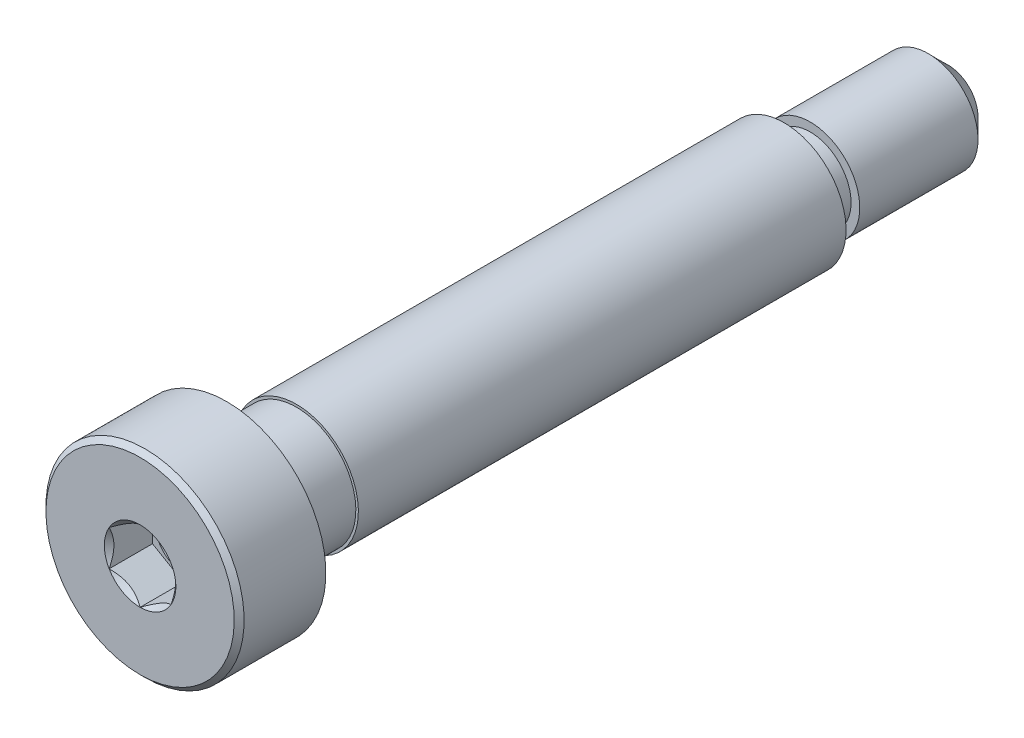
ISO-10303-21;
HEADER;
FILE_DESCRIPTION(('STEP AP214'),'2;1');
FILE_NAME('part.step','',(''),(''),'','','');
FILE_SCHEMA(('AUTOMOTIVE_DESIGN { 1 0 10303 214 1 1 1 1 }'));
ENDSEC;
DATA;
#1=APPLICATION_CONTEXT('core data for automotive mechanical design processes');
#2=APPLICATION_PROTOCOL_DEFINITION('international standard','automotive_design',2000,#1);
#3=PRODUCT_CONTEXT('',#1,'mechanical');
#4=PRODUCT('Part','Part','',(#3));
#5=PRODUCT_RELATED_PRODUCT_CATEGORY('part','',(#4));
#6=PRODUCT_DEFINITION_FORMATION('','',#4);
#7=PRODUCT_DEFINITION_CONTEXT('part definition',#1,'design');
#8=PRODUCT_DEFINITION('design','',#6,#7);
#9=PRODUCT_DEFINITION_SHAPE('','',#8);
#10=(LENGTH_UNIT() NAMED_UNIT(*) SI_UNIT(.MILLI.,.METRE.));
#11=(NAMED_UNIT(*) PLANE_ANGLE_UNIT() SI_UNIT($,.RADIAN.));
#12=(NAMED_UNIT(*) SI_UNIT($,.STERADIAN.) SOLID_ANGLE_UNIT());
#13=UNCERTAINTY_MEASURE_WITH_UNIT(LENGTH_MEASURE(1.E-05),#10,'distance_accuracy_value','');
#14=(GEOMETRIC_REPRESENTATION_CONTEXT(3) GLOBAL_UNCERTAINTY_ASSIGNED_CONTEXT((#13)) GLOBAL_UNIT_ASSIGNED_CONTEXT((#10,
#11,#12)) REPRESENTATION_CONTEXT('',''));
#15=CARTESIAN_POINT('',(0.,0.,0.));
#16=DIRECTION('',(0.,0.,1.));
#17=DIRECTION('',(1.,0.,0.));
#18=AXIS2_PLACEMENT_3D('',#15,#16,#17);
#19=CARTESIAN_POINT('',(0.,0.,32.6165));
#20=DIRECTION('',(0.,0.,1.));
#21=DIRECTION('',(0.,-1.,0.));
#22=AXIS2_PLACEMENT_3D('',#19,#20,#21);
#23=CYLINDRICAL_SURFACE('',#22,8.);
#24=CARTESIAN_POINT('',(0.,0.,25.6165));
#25=DIRECTION('',(0.,0.,1.));
#26=DIRECTION('',(0.,-1.,0.));
#27=AXIS2_PLACEMENT_3D('',#24,#25,#26);
#28=CIRCLE('',#27,8.);
#29=CARTESIAN_POINT('',(0.,-8.,25.6165));
#30=VERTEX_POINT('',#29);
#31=EDGE_CURVE('E174',#30,#30,#28,.T.);
#32=ORIENTED_EDGE('',*,*,#31,.T.);
#33=EDGE_LOOP('',(#32));
#34=FACE_BOUND('',#33,.T.);
#35=CARTESIAN_POINT('',(0.,0.,32.2165));
#36=DIRECTION('',(0.,0.,1.));
#37=DIRECTION('',(0.,-1.,0.));
#38=AXIS2_PLACEMENT_3D('',#35,#36,#37);
#39=CIRCLE('',#38,7.99999999999999);
#40=CARTESIAN_POINT('',(0.,-8.,32.2165));
#41=VERTEX_POINT('',#40);
#42=EDGE_CURVE('E452',#41,#41,#39,.T.);
#43=ORIENTED_EDGE('',*,*,#42,.F.);
#44=EDGE_LOOP('',(#43));
#45=FACE_BOUND('',#44,.T.);
#46=ADVANCED_FACE('F47',(#34,#45),#23,.T.);
#47=CARTESIAN_POINT('',(0.,5.,-19.3835));
#48=DIRECTION('',(0.,0.,1.));
#49=DIRECTION('',(0.,-1.,0.));
#50=AXIS2_PLACEMENT_3D('',#47,#48,#49);
#51=PLANE('',#50);
#52=CARTESIAN_POINT('',(0.,0.,-19.3835));
#53=DIRECTION('',(0.,0.,1.));
#54=DIRECTION('',(0.,-1.,0.));
#55=AXIS2_PLACEMENT_3D('',#52,#53,#54);
#56=CIRCLE('',#55,3.650794);
#57=CARTESIAN_POINT('',(0.,-3.650794,-19.3835));
#58=VERTEX_POINT('',#57);
#59=EDGE_CURVE('E147',#58,#58,#56,.T.);
#60=ORIENTED_EDGE('',*,*,#59,.T.);
#61=EDGE_LOOP('',(#60));
#62=FACE_BOUND('',#61,.T.);
#63=CARTESIAN_POINT('',(0.,0.,-19.3835));
#64=DIRECTION('',(0.,0.,1.));
#65=DIRECTION('',(0.,-1.,0.));
#66=AXIS2_PLACEMENT_3D('',#63,#64,#65);
#67=CIRCLE('',#66,4.);
#68=CARTESIAN_POINT('',(0.,-4.,-19.3835));
#69=VERTEX_POINT('',#68);
#70=EDGE_CURVE('E167',#69,#69,#67,.T.);
#71=ORIENTED_EDGE('',*,*,#70,.F.);
#72=EDGE_LOOP('',(#71));
#73=FACE_BOUND('',#72,.T.);
#74=ADVANCED_FACE('F259',(#62,#73),#51,.F.);
#75=CARTESIAN_POINT('',(0.,4.,-32.6165));
#76=DIRECTION('',(0.,0.,1.));
#77=DIRECTION('',(0.,-1.,0.));
#78=AXIS2_PLACEMENT_3D('',#75,#76,#77);
#79=PLANE('',#78);
#80=CARTESIAN_POINT('',(0.,0.,-32.6165));
#81=DIRECTION('',(0.,0.,1.));
#82=DIRECTION('',(0.,-1.,0.));
#83=AXIS2_PLACEMENT_3D('',#80,#81,#82);
#84=CIRCLE('',#83,2.42106159774998);
#85=CARTESIAN_POINT('',(0.,-2.42106159774999,-32.6165));
#86=VERTEX_POINT('',#85);
#87=EDGE_CURVE('E12',#86,#86,#84,.F.);
#88=ORIENTED_EDGE('',*,*,#87,.T.);
#89=EDGE_LOOP('',(#88));
#90=FACE_BOUND('',#89,.T.);
#91=ADVANCED_FACE('F267',(#90),#79,.F.);
#92=CARTESIAN_POINT('',(0.,0.,32.6165));
#93=DIRECTION('',(0.,0.,1.));
#94=DIRECTION('',(0.,-1.,0.));
#95=AXIS2_PLACEMENT_3D('',#92,#93,#94);
#96=CYLINDRICAL_SURFACE('',#95,4.);
#97=CARTESIAN_POINT('',(0.,0.,-31.03756159775));
#98=DIRECTION('',(0.,0.,1.));
#99=DIRECTION('',(0.,-1.,0.));
#100=AXIS2_PLACEMENT_3D('',#97,#98,#99);
#101=CIRCLE('',#100,4.);
#102=CARTESIAN_POINT('',(0.,-4.00000000000001,-31.03756159775));
#103=VERTEX_POINT('',#102);
#104=EDGE_CURVE('E55',#103,#103,#101,.T.);
#105=ORIENTED_EDGE('',*,*,#104,.T.);
#106=EDGE_LOOP('',(#105));
#107=FACE_BOUND('',#106,.T.);
#108=CARTESIAN_POINT('',(0.,0.,-21.488751203));
#109=DIRECTION('',(0.,0.,1.));
#110=DIRECTION('',(0.,-1.,0.));
#111=AXIS2_PLACEMENT_3D('',#108,#109,#110);
#112=CIRCLE('',#111,4.);
#113=CARTESIAN_POINT('',(0.,-4.00000000000001,-21.488751203));
#114=VERTEX_POINT('',#113);
#115=EDGE_CURVE('E158',#114,#114,#112,.T.);
#116=ORIENTED_EDGE('',*,*,#115,.F.);
#117=EDGE_LOOP('',(#116));
#118=FACE_BOUND('',#117,.T.);
#119=ADVANCED_FACE('F480',(#107,#118),#96,.T.);
#120=CARTESIAN_POINT('',(0.,3.301588,-21.488751203));
#121=DIRECTION('',(0.,0.,-1.));
#122=DIRECTION('',(0.,1.,0.));
#123=AXIS2_PLACEMENT_3D('',#120,#121,#122);
#124=PLANE('',#123);
#125=CARTESIAN_POINT('',(0.,0.,-21.488751203));
#126=DIRECTION('',(0.,0.,1.));
#127=DIRECTION('',(0.,-1.,0.));
#128=AXIS2_PLACEMENT_3D('',#125,#126,#127);
#129=CIRCLE('',#128,3.301588);
#130=CARTESIAN_POINT('',(0.,-3.301588,-21.488751203));
#131=VERTEX_POINT('',#130);
#132=EDGE_CURVE('E161',#131,#131,#129,.T.);
#133=ORIENTED_EDGE('',*,*,#132,.F.);
#134=EDGE_LOOP('',(#133));
#135=FACE_BOUND('',#134,.T.);
#136=ORIENTED_EDGE('',*,*,#115,.T.);
#137=EDGE_LOOP('',(#136));
#138=FACE_BOUND('',#137,.T.);
#139=ADVANCED_FACE('F307',(#135,#138),#124,.F.);
#140=CARTESIAN_POINT('',(0.,0.,32.6165));
#141=DIRECTION('',(0.,0.,1.));
#142=DIRECTION('',(0.,-1.,0.));
#143=AXIS2_PLACEMENT_3D('',#140,#141,#142);
#144=CYLINDRICAL_SURFACE('',#143,3.301588);
#145=CARTESIAN_POINT('',(0.,0.,-19.732706));
#146=DIRECTION('',(0.,0.,1.));
#147=DIRECTION('',(0.,-1.,0.));
#148=AXIS2_PLACEMENT_3D('',#145,#146,#147);
#149=CIRCLE('',#148,3.301588);
#150=CARTESIAN_POINT('',(0.,-3.301588,-19.732706));
#151=VERTEX_POINT('',#150);
#152=EDGE_CURVE('E164',#151,#151,#149,.T.);
#153=ORIENTED_EDGE('',*,*,#152,.F.);
#154=EDGE_LOOP('',(#153));
#155=FACE_BOUND('',#154,.T.);
#156=ORIENTED_EDGE('',*,*,#132,.T.);
#157=EDGE_LOOP('',(#156));
#158=FACE_BOUND('',#157,.T.);
#159=ADVANCED_FACE('F294',(#155,#158),#144,.T.);
#160=CARTESIAN_POINT('',(0.,0.,-19.732706));
#161=DIRECTION('',(0.,0.,1.));
#162=DIRECTION('',(0.,-1.,0.));
#163=AXIS2_PLACEMENT_3D('',#160,#161,#162);
#164=TOROIDAL_SURFACE('',#163,3.650794,0.349206000000001);
#165=ORIENTED_EDGE('',*,*,#59,.F.);
#166=EDGE_LOOP('',(#165));
#167=FACE_BOUND('',#166,.T.);
#168=ORIENTED_EDGE('',*,*,#152,.T.);
#169=EDGE_LOOP('',(#168));
#170=FACE_BOUND('',#169,.T.);
#171=ADVANCED_FACE('F289',(#167,#170),#164,.F.);
#172=CARTESIAN_POINT('',(0.,0.,-19.3835));
#173=DIRECTION('',(0.,0.,-1.));
#174=DIRECTION('',(0.,1.,0.));
#175=AXIS2_PLACEMENT_3D('',#172,#173,#174);
#176=CONICAL_SURFACE('',#175,4.,1.55055782061784);
#177=CARTESIAN_POINT('',(0.,0.,-19.3827289655528));
#178=DIRECTION('',(0.,0.,1.));
#179=DIRECTION('',(0.,-1.,0.));
#180=AXIS2_PLACEMENT_3D('',#177,#178,#179);
#181=CIRCLE('',#180,3.96190780255904);
#182=CARTESIAN_POINT('',(0.,-3.96190780255904,-19.3827289655528));
#183=VERTEX_POINT('',#182);
#184=EDGE_CURVE('E177',#183,#183,#181,.T.);
#185=ORIENTED_EDGE('',*,*,#184,.F.);
#186=EDGE_LOOP('',(#185));
#187=FACE_BOUND('',#186,.T.);
#188=ORIENTED_EDGE('',*,*,#70,.T.);
#189=EDGE_LOOP('',(#188));
#190=FACE_BOUND('',#189,.T.);
#191=ADVANCED_FACE('F286',(#187,#190),#176,.T.);
#192=CARTESIAN_POINT('',(0.,0.,19.9922710344473));
#193=DIRECTION('',(0.,0.,-1.));
#194=DIRECTION('',(0.,1.,0.));
#195=AXIS2_PLACEMENT_3D('',#192,#193,#194);
#196=CONICAL_SURFACE('',#195,4.75890780255904,1.55055782061775);
#197=CARTESIAN_POINT('',(0.,0.,19.9915));
#198=DIRECTION('',(0.,0.,1.));
#199=DIRECTION('',(0.,-1.,0.));
#200=AXIS2_PLACEMENT_3D('',#197,#198,#199);
#201=CIRCLE('',#200,4.797);
#202=CARTESIAN_POINT('',(0.,-4.797,19.9915));
#203=VERTEX_POINT('',#202);
#204=EDGE_CURVE('E173',#203,#203,#201,.T.);
#205=ORIENTED_EDGE('',*,*,#204,.F.);
#206=EDGE_LOOP('',(#205));
#207=FACE_BOUND('',#206,.T.);
#208=CARTESIAN_POINT('',(0.,0.,19.9922710344473));
#209=DIRECTION('',(0.,0.,1.));
#210=DIRECTION('',(0.,-1.,0.));
#211=AXIS2_PLACEMENT_3D('',#208,#209,#210);
#212=CIRCLE('',#211,4.75890780255904);
#213=CARTESIAN_POINT('',(0.,-4.75890780255904,19.9922710344473));
#214=VERTEX_POINT('',#213);
#215=EDGE_CURVE('E178',#214,#214,#212,.T.);
#216=ORIENTED_EDGE('',*,*,#215,.T.);
#217=EDGE_LOOP('',(#216));
#218=FACE_BOUND('',#217,.T.);
#219=ADVANCED_FACE('F282',(#207,#218),#196,.F.);
#220=CARTESIAN_POINT('',(0.,0.,19.9922710344473));
#221=DIRECTION('',(0.,0.,1.));
#222=DIRECTION('',(0.,-1.,0.));
#223=AXIS2_PLACEMENT_3D('',#220,#221,#222);
#224=CONICAL_SURFACE('',#223,4.75890780255904,0.0202385061771095);
#225=ORIENTED_EDGE('',*,*,#184,.T.);
#226=EDGE_LOOP('',(#225));
#227=FACE_BOUND('',#226,.T.);
#228=ORIENTED_EDGE('',*,*,#215,.F.);
#229=EDGE_LOOP('',(#228));
#230=FACE_BOUND('',#229,.T.);
#231=ADVANCED_FACE('F279',(#227,#230),#224,.T.);
#232=CARTESIAN_POINT('',(0.,7.99999999999999,25.6165));
#233=DIRECTION('',(0.,0.,1.));
#234=DIRECTION('',(0.,-1.,0.));
#235=AXIS2_PLACEMENT_3D('',#232,#233,#234);
#236=PLANE('',#235);
#237=ORIENTED_EDGE('',*,*,#31,.F.);
#238=EDGE_LOOP('',(#237));
#239=FACE_BOUND('',#238,.T.);
#240=CARTESIAN_POINT('',(0.,0.,25.6165));
#241=DIRECTION('',(0.,0.,1.));
#242=DIRECTION('',(0.,-1.,0.));
#243=AXIS2_PLACEMENT_3D('',#240,#241,#242);
#244=CIRCLE('',#243,4.797);
#245=CARTESIAN_POINT('',(0.,-4.797,25.6165));
#246=VERTEX_POINT('',#245);
#247=EDGE_CURVE('E170',#246,#246,#244,.T.);
#248=ORIENTED_EDGE('',*,*,#247,.T.);
#249=EDGE_LOOP('',(#248));
#250=FACE_BOUND('',#249,.T.);
#251=ADVANCED_FACE('F272',(#239,#250),#236,.F.);
#252=CARTESIAN_POINT('',(0.,0.,32.6165));
#253=DIRECTION('',(0.,0.,1.));
#254=DIRECTION('',(0.,-1.,0.));
#255=AXIS2_PLACEMENT_3D('',#252,#253,#254);
#256=CYLINDRICAL_SURFACE('',#255,4.797);
#257=ORIENTED_EDGE('',*,*,#247,.F.);
#258=EDGE_LOOP('',(#257));
#259=FACE_BOUND('',#258,.T.);
#260=ORIENTED_EDGE('',*,*,#204,.T.);
#261=EDGE_LOOP('',(#260));
#262=FACE_BOUND('',#261,.T.);
#263=ADVANCED_FACE('F313',(#259,#262),#256,.T.);
#264=CARTESIAN_POINT('',(0.,0.,-31.03756159775));
#265=DIRECTION('',(0.,0.,1.));
#266=DIRECTION('',(0.,-1.,0.));
#267=AXIS2_PLACEMENT_3D('',#264,#265,#266);
#268=CONICAL_SURFACE('',#267,4.,0.78539816339745);
#269=ORIENTED_EDGE('',*,*,#87,.F.);
#270=EDGE_LOOP('',(#269));
#271=FACE_BOUND('',#270,.T.);
#272=ORIENTED_EDGE('',*,*,#104,.F.);
#273=EDGE_LOOP('',(#272));
#274=FACE_BOUND('',#273,.T.);
#275=ADVANCED_FACE('F49',(#271,#274),#268,.T.);
#276=CARTESIAN_POINT('',(0.,0.,32.6165));
#277=DIRECTION('',(0.,0.,-1.));
#278=DIRECTION('',(0.,1.,0.));
#279=AXIS2_PLACEMENT_3D('',#276,#277,#278);
#280=CONICAL_SURFACE('',#279,7.6,0.785398163397449);
#281=ORIENTED_EDGE('',*,*,#42,.T.);
#282=EDGE_LOOP('',(#281));
#283=FACE_BOUND('',#282,.T.);
#284=CARTESIAN_POINT('',(0.,0.,32.6165));
#285=DIRECTION('',(0.,0.,1.));
#286=DIRECTION('',(0.,-1.,0.));
#287=AXIS2_PLACEMENT_3D('',#284,#285,#286);
#288=CIRCLE('',#287,7.6);
#289=CARTESIAN_POINT('',(0.,-7.6,32.6165));
#290=VERTEX_POINT('',#289);
#291=EDGE_CURVE('E448',#290,#290,#288,.T.);
#292=ORIENTED_EDGE('',*,*,#291,.F.);
#293=EDGE_LOOP('',(#292));
#294=FACE_BOUND('',#293,.T.);
#295=ADVANCED_FACE('F203',(#283,#294),#280,.T.);
#296=CARTESIAN_POINT('',(0.,0.,29.1165));
#297=DIRECTION('',(0.,0.,1.));
#298=DIRECTION('',(1.,0.,0.));
#299=AXIS2_PLACEMENT_3D('',#296,#297,#298);
#300=PLANE('',#299);
#301=CARTESIAN_POINT('',(0.,0.,29.1165));
#302=DIRECTION('',(0.,0.,1.));
#303=DIRECTION('',(1.,0.,0.));
#304=AXIS2_PLACEMENT_3D('',#301,#302,#303);
#305=CIRCLE('',#304,2.25);
#306=CARTESIAN_POINT('',(2.25,0.,29.1165));
#307=VERTEX_POINT('',#306);
#308=EDGE_CURVE('E449',#307,#307,#305,.T.);
#309=ORIENTED_EDGE('',*,*,#308,.F.);
#310=EDGE_LOOP('',(#309));
#311=FACE_BOUND('',#310,.T.);
#312=DIRECTION('',(-0.866025403784439,0.499999999999999,0.));
#313=VECTOR('',#312,1.);
#314=CARTESIAN_POINT('',(2.5,1.44337567297407,29.1165));
#315=LINE('',#314,#313);
#316=CARTESIAN_POINT('',(2.5,1.44337567297407,29.1165));
#317=VERTEX_POINT('',#316);
#318=CARTESIAN_POINT('',(0.,2.88675134594813,29.1165));
#319=VERTEX_POINT('',#318);
#320=EDGE_CURVE('E106',#317,#319,#315,.T.);
#321=ORIENTED_EDGE('',*,*,#320,.T.);
#322=DIRECTION('',(-0.866025403784438,-0.5,0.));
#323=VECTOR('',#322,1.);
#324=CARTESIAN_POINT('',(0.,2.88675134594813,29.1165));
#325=LINE('',#324,#323);
#326=CARTESIAN_POINT('',(-2.5,1.44337567297406,29.1165));
#327=VERTEX_POINT('',#326);
#328=EDGE_CURVE('E116',#319,#327,#325,.T.);
#329=ORIENTED_EDGE('',*,*,#328,.T.);
#330=DIRECTION('',(0.,-1.,0.));
#331=VECTOR('',#330,1.);
#332=CARTESIAN_POINT('',(-2.5,1.44337567297406,29.1165));
#333=LINE('',#332,#331);
#334=CARTESIAN_POINT('',(-2.5,-1.44337567297407,29.1165));
#335=VERTEX_POINT('',#334);
#336=EDGE_CURVE('E122',#327,#335,#333,.T.);
#337=ORIENTED_EDGE('',*,*,#336,.T.);
#338=DIRECTION('',(0.866025403784439,-0.5,0.));
#339=VECTOR('',#338,1.);
#340=CARTESIAN_POINT('',(-2.5,-1.44337567297407,29.1165));
#341=LINE('',#340,#339);
#342=CARTESIAN_POINT('',(0.,-2.88675134594813,29.1165));
#343=VERTEX_POINT('',#342);
#344=EDGE_CURVE('E139',#335,#343,#341,.T.);
#345=ORIENTED_EDGE('',*,*,#344,.T.);
#346=DIRECTION('',(0.866025403784438,0.5,0.));
#347=VECTOR('',#346,1.);
#348=CARTESIAN_POINT('',(0.,-2.88675134594813,29.1165));
#349=LINE('',#348,#347);
#350=CARTESIAN_POINT('',(2.5,-1.44337567297406,29.1165));
#351=VERTEX_POINT('',#350);
#352=EDGE_CURVE('E142',#343,#351,#349,.T.);
#353=ORIENTED_EDGE('',*,*,#352,.T.);
#354=DIRECTION('',(0.,1.,0.));
#355=VECTOR('',#354,1.);
#356=CARTESIAN_POINT('',(2.5,-1.44337567297406,29.1165));
#357=LINE('',#356,#355);
#358=EDGE_CURVE('E113',#351,#317,#357,.T.);
#359=ORIENTED_EDGE('',*,*,#358,.T.);
#360=EDGE_LOOP('',(#321,#329,#337,#345,#353,#359));
#361=FACE_BOUND('',#360,.T.);
#362=ADVANCED_FACE('F124',(#311,#361),#300,.T.);
#363=CARTESIAN_POINT('',(-2.5,1.44337567297406,29.1165));
#364=DIRECTION('',(-1.,0.,0.));
#365=DIRECTION('',(0.,0.,1.));
#366=AXIS2_PLACEMENT_3D('',#363,#364,#365);
#367=PLANE('',#366);
#368=DIRECTION('',(0.,0.,1.));
#369=VECTOR('',#368,1.);
#370=CARTESIAN_POINT('',(-2.5,1.44337567297406,29.1165));
#371=LINE('',#370,#369);
#372=CARTESIAN_POINT('',(-2.5,1.44337567297407,32.6165));
#373=VERTEX_POINT('',#372);
#374=EDGE_CURVE('E112',#327,#373,#371,.T.);
#375=ORIENTED_EDGE('',*,*,#374,.T.);
#376=CARTESIAN_POINT('',(-2.5,-2.87868021616155,33.5424641937846));
#377=CARTESIAN_POINT('',(-2.5,-2.80858751756355,33.4895547693995));
#378=CARTESIAN_POINT('',(-2.5,-2.73810237384458,33.4371567848064));
#379=CARTESIAN_POINT('',(-2.5,-2.5961923890747,33.3336126835152));
#380=CARTESIAN_POINT('',(-2.5,-2.52476731657143,33.2824668843779));
#381=CARTESIAN_POINT('',(-2.5,-2.38030019419699,33.1812924979814));
#382=CARTESIAN_POINT('',(-2.5,-2.307249903594,33.1312756377845));
#383=CARTESIAN_POINT('',(-2.5,-2.15990937397294,33.0331088439155));
#384=CARTESIAN_POINT('',(-2.5,-2.08561922308944,32.9849587783455));
#385=CARTESIAN_POINT('',(-2.5,-1.93130274871409,32.888246559452));
#386=CARTESIAN_POINT('',(-2.5,-1.85119168497851,32.8398189325373));
#387=CARTESIAN_POINT('',(-2.5,-1.68912282627168,32.7461640597041));
#388=CARTESIAN_POINT('',(-2.5,-1.60716527674864,32.7009363916948));
#389=CARTESIAN_POINT('',(-2.5,-1.44137668632319,32.6146353746693));
#390=CARTESIAN_POINT('',(-2.5,-1.35755175925796,32.5735503726636));
#391=CARTESIAN_POINT('',(-2.5,-1.18761577759421,32.4964618661066));
#392=CARTESIAN_POINT('',(-2.5,-1.1015057792473,32.4604560607346));
#393=CARTESIAN_POINT('',(-2.5,-0.933895283730376,32.3974497442851));
#394=CARTESIAN_POINT('',(-2.5,-0.852581486652414,32.3699577201431));
#395=CARTESIAN_POINT('',(-2.5,-0.687996185051427,32.3214971144174));
#396=CARTESIAN_POINT('',(-2.5,-0.604724546085164,32.300528982239));
#397=CARTESIAN_POINT('',(-2.5,-0.43810578650165,32.266559995013));
#398=CARTESIAN_POINT('',(-2.5,-0.354786957377882,32.2534226334436));
#399=CARTESIAN_POINT('',(-2.5,-0.187258638268773,32.2353701943996));
#400=CARTESIAN_POINT('',(-2.5,-0.103049303891734,32.2304537035302));
#401=CARTESIAN_POINT('',(-2.5,0.0623819458555484,32.2292080743719));
#402=CARTESIAN_POINT('',(-2.5,0.143601667742494,32.2325745517109));
#403=CARTESIAN_POINT('',(-2.5,0.305344840533964,32.2470375923809));
#404=CARTESIAN_POINT('',(-2.5,0.385868223029658,32.2581349066531));
#405=CARTESIAN_POINT('',(-2.5,0.546999992477731,32.2876420785853));
#406=CARTESIAN_POINT('',(-2.5,0.62758525815638,32.3061763768309));
#407=CARTESIAN_POINT('',(-2.5,0.786991930978588,32.3495723320141));
#408=CARTESIAN_POINT('',(-2.5,0.865813485110825,32.3744334595174));
#409=CARTESIAN_POINT('',(-2.5,1.11399280220491,32.4620589112399));
#410=CARTESIAN_POINT('',(-2.5,1.27984027529456,32.5348033354746));
#411=CARTESIAN_POINT('',(-2.5,1.52253018655038,32.6560423452678));
#412=CARTESIAN_POINT('',(-2.5,1.60256472908879,32.6985714512072));
#413=CARTESIAN_POINT('',(-2.5,1.76081489282124,32.7868965241522));
#414=CARTESIAN_POINT('',(-2.5,1.83903083842886,32.8326919024767));
#415=CARTESIAN_POINT('',(-2.5,1.99000684607167,32.9245446787286));
#416=CARTESIAN_POINT('',(-2.5,2.06284472030444,32.9704756354244));
#417=CARTESIAN_POINT('',(-2.5,2.20727164736135,33.0642702453865));
#418=CARTESIAN_POINT('',(-2.5,2.27886060500402,33.1121340450436));
#419=CARTESIAN_POINT('',(-2.5,2.42037078548403,33.2090522363183));
#420=CARTESIAN_POINT('',(-2.5,2.49030083172878,33.2580937983162));
#421=CARTESIAN_POINT('',(-2.5,2.62920524991558,33.3574738351898));
#422=CARTESIAN_POINT('',(-2.5,2.69817987937839,33.4078119497074));
#423=CARTESIAN_POINT('',(-2.5,2.76675463365823,33.4586802976824));
#424=B_SPLINE_CURVE_WITH_KNOTS('',3,(#376,#377,#378,#379,#380,#381,#382,#383,#384,#385,#386,
#387,#388,#389,#390,#391,#392,#393,#394,#395,#396,#397,#398,#399,#400,#401,#402,#403,#404,#405,
#406,#407,#408,#409,#410,#411,#412,#413,#414,#415,#416,#417,#418,#419,#420,#421,#422,#423),
.UNSPECIFIED.,.F.,.F.,(4,2,2,2,2,2,2,2,2,2,2,2,2,2,2,2,2,2,2,2,2,2,2,4),(0.,0.263465914971116,
0.526997968323237,0.79257194327936,1.05812711983772,1.33890112548019,1.61963802629079,
1.89956181222216,2.17935838571898,2.436638876826,2.69393708705248,2.94660788173135,
3.19923523085016,3.44271854486787,3.6862255131336,3.93398926860573,4.18173229781969,
4.72334004841908,4.99521600382014,5.26704308216966,5.52534341671993,5.78366335141086,
6.03988492204047,6.29603603207542),.UNSPECIFIED.);
#425=CARTESIAN_POINT('',(-2.5,-1.44337567297407,32.6165));
#426=VERTEX_POINT('',#425);
#427=EDGE_CURVE('E211',#373,#426,#424,.F.);
#428=ORIENTED_EDGE('',*,*,#427,.T.);
#429=DIRECTION('',(0.,0.,1.));
#430=VECTOR('',#429,1.);
#431=CARTESIAN_POINT('',(-2.5,-1.44337567297407,29.1165));
#432=LINE('',#431,#430);
#433=EDGE_CURVE('E154',#335,#426,#432,.T.);
#434=ORIENTED_EDGE('',*,*,#433,.F.);
#435=ORIENTED_EDGE('',*,*,#336,.F.);
#436=EDGE_LOOP('',(#375,#428,#434,#435));
#437=FACE_BOUND('',#436,.T.);
#438=ADVANCED_FACE('F248',(#437),#367,.F.);
#439=CARTESIAN_POINT('',(-2.5,-1.44337567297407,29.1165));
#440=DIRECTION('',(-0.499999999999999,-0.866025403784439,0.));
#441=DIRECTION('',(0.866025403784439,-0.5,0.));
#442=AXIS2_PLACEMENT_3D('',#439,#440,#441);
#443=PLANE('',#442);
#444=ORIENTED_EDGE('',*,*,#433,.T.);
#445=CARTESIAN_POINT('',(-2.5002,-1.44326020292023,32.6166154769818));
#446=CARTESIAN_POINT('',(-2.41426172221223,-1.49287669073469,32.5670407053547));
#447=CARTESIAN_POINT('',(-2.32688643272424,-1.5433228376411,32.5203774813625));
#448=CARTESIAN_POINT('',(-2.14871854383441,-1.64618811625259,32.4349381400383));
#449=CARTESIAN_POINT('',(-2.05790899931892,-1.6986170312236,32.396209562406));
#450=CARTESIAN_POINT('',(-1.87479587687308,-1.80433744175986,32.3298667038977));
#451=CARTESIAN_POINT('',(-1.78253893547066,-1.85760201171316,32.3020856685309));
#452=CARTESIAN_POINT('',(-1.59599399122371,-1.96530378549009,32.2592831759107));
#453=CARTESIAN_POINT('',(-1.50171168743371,-2.01973769896307,32.2442297666713));
#454=CARTESIAN_POINT('',(-1.33922174170815,-2.11355131286833,32.2306477222095));
#455=CARTESIAN_POINT('',(-1.27122403211985,-2.15280980880341,32.2286370992408));
#456=CARTESIAN_POINT('',(-1.13533975883078,-2.23126263056549,32.2320241171875));
#457=CARTESIAN_POINT('',(-1.06745324244776,-2.27045692907358,32.2374243552998));
#458=CARTESIAN_POINT('',(-0.932321211763892,-2.34847544336505,32.2553257884025));
#459=CARTESIAN_POINT('',(-0.865076500246438,-2.38729919566123,32.2678349270465));
#460=CARTESIAN_POINT('',(-0.731749899181799,-2.46427534467604,32.2992675019557));
#461=CARTESIAN_POINT('',(-0.665667920900341,-2.50242779262542,32.3181904464968));
#462=CARTESIAN_POINT('',(-0.496403653308733,-2.60015256308362,32.3743673614082));
#463=CARTESIAN_POINT('',(-0.394270877777105,-2.65911894852989,32.4158558315962));
#464=CARTESIAN_POINT('',(-0.244093585059489,-2.74582384890657,32.4858940467231));
#465=CARTESIAN_POINT('',(-0.194603460117389,-2.77439698586412,32.5105022521161));
#466=CARTESIAN_POINT('',(-0.0965399361611518,-2.83101398781794,32.5619618867152));
#467=CARTESIAN_POINT('',(-0.0479659965030709,-2.85905816495513,32.5888119387794));
#468=CARTESIAN_POINT('',(0.00020000000000146,-2.88686681600197,32.6166154769818));
#469=B_SPLINE_CURVE_WITH_KNOTS('',3,(#445,#446,#447,#448,#449,#450,#451,#452,#453,#454,#455,
#456,#457,#458,#459,#460,#461,#462,#463,#464,#465,#466,#467,#468),.UNSPECIFIED.,.F.,.F.,(4,2,2,
2,2,2,2,2,2,2,2,4),(0.,0.333012085133924,0.6679645183014,0.9975970320433,1.32639954393844,
1.56169424147169,1.79707142102083,2.03271213522171,2.26833478775651,2.64260240809533,
2.82922877818864,3.01574133749025),.UNSPECIFIED.);
#470=CARTESIAN_POINT('',(0.,-2.88675134594813,32.6165));
#471=VERTEX_POINT('',#470);
#472=EDGE_CURVE('E219',#426,#471,#469,.T.);
#473=ORIENTED_EDGE('',*,*,#472,.T.);
#474=DIRECTION('',(0.,0.,1.));
#475=VECTOR('',#474,1.);
#476=CARTESIAN_POINT('',(0.,-2.88675134594813,29.1165));
#477=LINE('',#476,#475);
#478=EDGE_CURVE('E151',#343,#471,#477,.T.);
#479=ORIENTED_EDGE('',*,*,#478,.F.);
#480=ORIENTED_EDGE('',*,*,#344,.F.);
#481=EDGE_LOOP('',(#444,#473,#479,#480));
#482=FACE_BOUND('',#481,.T.);
#483=ADVANCED_FACE('F244',(#482),#443,.F.);
#484=CARTESIAN_POINT('',(0.,-2.88675134594813,29.1165));
#485=DIRECTION('',(0.5,-0.866025403784438,0.));
#486=DIRECTION('',(0.866025403784438,0.5,0.));
#487=AXIS2_PLACEMENT_3D('',#484,#485,#486);
#488=PLANE('',#487);
#489=ORIENTED_EDGE('',*,*,#478,.T.);
#490=CARTESIAN_POINT('',(-0.000199999999996979,-2.88686681600197,32.6166154769818));
#491=CARTESIAN_POINT('',(0.0857382777877688,-2.83725032818751,32.5670407053547));
#492=CARTESIAN_POINT('',(0.173113567275757,-2.7868041812811,32.5203774813625));
#493=CARTESIAN_POINT('',(0.351281456165593,-2.6839389026696,32.4349381400383));
#494=CARTESIAN_POINT('',(0.442091000681079,-2.6315099876986,32.396209562406));
#495=CARTESIAN_POINT('',(0.625204123126925,-2.52578957716234,32.3298667038977));
#496=CARTESIAN_POINT('',(0.717461064529345,-2.47252500720904,32.3020856685309));
#497=CARTESIAN_POINT('',(0.90400600877629,-2.3648232334321,32.2592831759107));
#498=CARTESIAN_POINT('',(0.998288312566287,-2.31038931995913,32.2442297666713));
#499=CARTESIAN_POINT('',(1.16077825829185,-2.21657570605387,32.2306477222095));
#500=CARTESIAN_POINT('',(1.22877596788015,-2.17731721011878,32.2286370992408));
#501=CARTESIAN_POINT('',(1.36466024116922,-2.0988643883567,32.2320241171875));
#502=CARTESIAN_POINT('',(1.43254675755224,-2.05967008984862,32.2374243552998));
#503=CARTESIAN_POINT('',(1.56767878823611,-1.98165157555715,32.2553257884025));
#504=CARTESIAN_POINT('',(1.63492349975356,-1.94282782326096,32.2678349270465));
#505=CARTESIAN_POINT('',(1.7682501008182,-1.86585167424616,32.2992675019557));
#506=CARTESIAN_POINT('',(1.83433207909966,-1.82769922629678,32.3181904464968));
#507=CARTESIAN_POINT('',(2.00359634669127,-1.72997445583858,32.3743673614082));
#508=CARTESIAN_POINT('',(2.1057291222229,-1.67100807039231,32.4158558315962));
#509=CARTESIAN_POINT('',(2.25590641494051,-1.58430317001562,32.4858940467231));
#510=CARTESIAN_POINT('',(2.30539653988261,-1.55573003305807,32.5105022521161));
#511=CARTESIAN_POINT('',(2.40346006383885,-1.49911303110426,32.5619618867152));
#512=CARTESIAN_POINT('',(2.45203400349693,-1.47106885396706,32.5888119387794));
#513=CARTESIAN_POINT('',(2.5002,-1.44326020292023,32.6166154769818));
#514=B_SPLINE_CURVE_WITH_KNOTS('',3,(#490,#491,#492,#493,#494,#495,#496,#497,#498,#499,#500,
#501,#502,#503,#504,#505,#506,#507,#508,#509,#510,#511,#512,#513),.UNSPECIFIED.,.F.,.F.,(4,2,2,
2,2,2,2,2,2,2,2,4),(0.,0.333012085133924,0.6679645183014,0.9975970320433,1.32639954393844,
1.56169424147169,1.79707142102083,2.03271213522171,2.26833478775651,2.64260240809533,
2.82922877818863,3.01574133749024),.UNSPECIFIED.);
#515=CARTESIAN_POINT('',(2.5,-1.44337567297406,32.6165));
#516=VERTEX_POINT('',#515);
#517=EDGE_CURVE('E226',#471,#516,#514,.T.);
#518=ORIENTED_EDGE('',*,*,#517,.T.);
#519=DIRECTION('',(0.,0.,1.));
#520=VECTOR('',#519,1.);
#521=CARTESIAN_POINT('',(2.5,-1.44337567297406,29.1165));
#522=LINE('',#521,#520);
#523=EDGE_CURVE('E148',#351,#516,#522,.T.);
#524=ORIENTED_EDGE('',*,*,#523,.F.);
#525=ORIENTED_EDGE('',*,*,#352,.F.);
#526=EDGE_LOOP('',(#489,#518,#524,#525));
#527=FACE_BOUND('',#526,.T.);
#528=ADVANCED_FACE('F240',(#527),#488,.F.);
#529=CARTESIAN_POINT('',(2.5,-1.44337567297406,29.1165));
#530=DIRECTION('',(1.,0.,0.));
#531=DIRECTION('',(0.,0.,-1.));
#532=AXIS2_PLACEMENT_3D('',#529,#530,#531);
#533=PLANE('',#532);
#534=ORIENTED_EDGE('',*,*,#523,.T.);
#535=CARTESIAN_POINT('',(2.5,-2.87868021616155,33.5424641937846));
#536=CARTESIAN_POINT('',(2.5,-2.80858751756355,33.4895547693995));
#537=CARTESIAN_POINT('',(2.5,-2.73810237384458,33.4371567848064));
#538=CARTESIAN_POINT('',(2.5,-2.5961923890747,33.3336126835152));
#539=CARTESIAN_POINT('',(2.5,-2.52476731657143,33.2824668843779));
#540=CARTESIAN_POINT('',(2.5,-2.38030019419698,33.1812924979814));
#541=CARTESIAN_POINT('',(2.5,-2.307249903594,33.1312756377845));
#542=CARTESIAN_POINT('',(2.5,-2.15990937397294,33.0331088439155));
#543=CARTESIAN_POINT('',(2.5,-2.08561922308943,32.9849587783455));
#544=CARTESIAN_POINT('',(2.5,-1.93130274871408,32.888246559452));
#545=CARTESIAN_POINT('',(2.5,-1.8511916849785,32.8398189325373));
#546=CARTESIAN_POINT('',(2.5,-1.68912282627167,32.7461640597041));
#547=CARTESIAN_POINT('',(2.5,-1.60716527674864,32.7009363916948));
#548=CARTESIAN_POINT('',(2.5,-1.44137668632319,32.6146353746693));
#549=CARTESIAN_POINT('',(2.5,-1.35755175925796,32.5735503726636));
#550=CARTESIAN_POINT('',(2.5,-1.1876157775942,32.4964618661066));
#551=CARTESIAN_POINT('',(2.5,-1.10150577924729,32.4604560607346));
#552=CARTESIAN_POINT('',(2.5,-0.933895283730374,32.3974497442851));
#553=CARTESIAN_POINT('',(2.5,-0.852581486652412,32.3699577201431));
#554=CARTESIAN_POINT('',(2.5,-0.687996185051425,32.3214971144174));
#555=CARTESIAN_POINT('',(2.5,-0.604724546085162,32.300528982239));
#556=CARTESIAN_POINT('',(2.5,-0.438105786501648,32.266559995013));
#557=CARTESIAN_POINT('',(2.5,-0.35478695737788,32.2534226334436));
#558=CARTESIAN_POINT('',(2.5,-0.187258638268771,32.2353701943996));
#559=CARTESIAN_POINT('',(2.5,-0.103049303891732,32.2304537035302));
#560=CARTESIAN_POINT('',(2.5,0.0623819458555496,32.2292080743719));
#561=CARTESIAN_POINT('',(2.5,0.143601667742495,32.2325745517109));
#562=CARTESIAN_POINT('',(2.5,0.305344840533965,32.2470375923809));
#563=CARTESIAN_POINT('',(2.5,0.385868223029659,32.2581349066531));
#564=CARTESIAN_POINT('',(2.5,0.546999992477732,32.2876420785853));
#565=CARTESIAN_POINT('',(2.5,0.627585258156381,32.3061763768309));
#566=CARTESIAN_POINT('',(2.5,0.786991930978588,32.3495723320141));
#567=CARTESIAN_POINT('',(2.5,0.865813485110825,32.3744334595174));
#568=CARTESIAN_POINT('',(2.5,1.11399280220491,32.4620589112399));
#569=CARTESIAN_POINT('',(2.5,1.27984027529456,32.5348033354746));
#570=CARTESIAN_POINT('',(2.5,1.52253018655038,32.6560423452678));
#571=CARTESIAN_POINT('',(2.5,1.60256472908879,32.6985714512072));
#572=CARTESIAN_POINT('',(2.5,1.76081489282124,32.7868965241522));
#573=CARTESIAN_POINT('',(2.5,1.83903083842886,32.8326919024767));
#574=CARTESIAN_POINT('',(2.5,1.99000684607167,32.9245446787286));
#575=CARTESIAN_POINT('',(2.5,2.06284472030444,32.9704756354244));
#576=CARTESIAN_POINT('',(2.5,2.20727164736135,33.0642702453865));
#577=CARTESIAN_POINT('',(2.5,2.27886060500402,33.1121340450436));
#578=CARTESIAN_POINT('',(2.5,2.42037078548403,33.2090522363183));
#579=CARTESIAN_POINT('',(2.5,2.49030083172878,33.2580937983162));
#580=CARTESIAN_POINT('',(2.5,2.62920524991558,33.3574738351898));
#581=CARTESIAN_POINT('',(2.5,2.69817987937839,33.4078119497074));
#582=CARTESIAN_POINT('',(2.5,2.76675463365823,33.4586802976824));
#583=B_SPLINE_CURVE_WITH_KNOTS('',3,(#535,#536,#537,#538,#539,#540,#541,#542,#543,#544,#545,
#546,#547,#548,#549,#550,#551,#552,#553,#554,#555,#556,#557,#558,#559,#560,#561,#562,#563,#564,
#565,#566,#567,#568,#569,#570,#571,#572,#573,#574,#575,#576,#577,#578,#579,#580,#581,#582),
.UNSPECIFIED.,.F.,.F.,(4,2,2,2,2,2,2,2,2,2,2,2,2,2,2,2,2,2,2,2,2,2,2,4),(0.,0.263465914971114,
0.526997968323236,0.792571943279359,1.05812711983772,1.33890112548019,1.61963802629079,
1.89956181222216,2.17935838571897,2.436638876826,2.69393708705248,2.94660788173135,
3.19923523085016,3.44271854486786,3.6862255131336,3.93398926860573,4.18173229781968,
4.72334004841908,4.99521600382014,5.26704308216966,5.52534341671993,5.78366335141086,
6.03988492204047,6.29603603207541),.UNSPECIFIED.);
#584=CARTESIAN_POINT('',(2.5,1.44337567297406,32.6165));
#585=VERTEX_POINT('',#584);
#586=EDGE_CURVE('E128',#516,#585,#583,.T.);
#587=ORIENTED_EDGE('',*,*,#586,.T.);
#588=DIRECTION('',(0.,0.,1.));
#589=VECTOR('',#588,1.);
#590=CARTESIAN_POINT('',(2.5,1.44337567297407,29.1165));
#591=LINE('',#590,#589);
#592=EDGE_CURVE('E145',#317,#585,#591,.T.);
#593=ORIENTED_EDGE('',*,*,#592,.F.);
#594=ORIENTED_EDGE('',*,*,#358,.F.);
#595=EDGE_LOOP('',(#534,#587,#593,#594));
#596=FACE_BOUND('',#595,.T.);
#597=ADVANCED_FACE('F237',(#596),#533,.F.);
#598=CARTESIAN_POINT('',(2.5,1.44337567297407,29.1165));
#599=DIRECTION('',(0.499999999999999,0.866025403784439,0.));
#600=DIRECTION('',(-0.866025403784439,0.499999999999999,0.));
#601=AXIS2_PLACEMENT_3D('',#598,#599,#600);
#602=PLANE('',#601);
#603=ORIENTED_EDGE('',*,*,#592,.T.);
#604=CARTESIAN_POINT('',(2.5002,1.44326020292023,32.6166154769818));
#605=CARTESIAN_POINT('',(2.41426172221224,1.49287669073469,32.5670407053547));
#606=CARTESIAN_POINT('',(2.32688643272425,1.5433228376411,32.5203774813625));
#607=CARTESIAN_POINT('',(2.14871854383441,1.64618811625259,32.4349381400383));
#608=CARTESIAN_POINT('',(2.05790899931893,1.6986170312236,32.396209562406));
#609=CARTESIAN_POINT('',(1.87479587687308,1.80433744175986,32.3298667038977));
#610=CARTESIAN_POINT('',(1.78253893547066,1.85760201171315,32.3020856685309));
#611=CARTESIAN_POINT('',(1.59599399122372,1.96530378549009,32.2592831759107));
#612=CARTESIAN_POINT('',(1.50171168743372,2.01973769896307,32.2442297666713));
#613=CARTESIAN_POINT('',(1.33922174170816,2.11355131286833,32.2306477222095));
#614=CARTESIAN_POINT('',(1.27122403211985,2.15280980880341,32.2286370992408));
#615=CARTESIAN_POINT('',(1.13533975883078,2.23126263056549,32.2320241171875));
#616=CARTESIAN_POINT('',(1.06745324244776,2.27045692907357,32.2374243552998));
#617=CARTESIAN_POINT('',(0.932321211763896,2.34847544336505,32.2553257884025));
#618=CARTESIAN_POINT('',(0.865076500246441,2.38729919566123,32.2678349270465));
#619=CARTESIAN_POINT('',(0.731749899181803,2.46427534467603,32.2992675019557));
#620=CARTESIAN_POINT('',(0.665667920900344,2.50242779262542,32.3181904464968));
#621=CARTESIAN_POINT('',(0.496403653308738,2.60015256308361,32.3743673614082));
#622=CARTESIAN_POINT('',(0.39427087777711,2.65911894852988,32.4158558315962));
#623=CARTESIAN_POINT('',(0.244093585059494,2.74582384890657,32.4858940467231));
#624=CARTESIAN_POINT('',(0.194603460117393,2.77439698586412,32.5105022521161));
#625=CARTESIAN_POINT('',(0.0965399361611546,2.83101398781794,32.5619618867152));
#626=CARTESIAN_POINT('',(0.047965996503073,2.85905816495513,32.5888119387794));
#627=CARTESIAN_POINT('',(-0.000200000000000065,2.88686681600197,32.6166154769818));
#628=B_SPLINE_CURVE_WITH_KNOTS('',3,(#604,#605,#606,#607,#608,#609,#610,#611,#612,#613,#614,
#615,#616,#617,#618,#619,#620,#621,#622,#623,#624,#625,#626,#627),.UNSPECIFIED.,.F.,.F.,(4,2,2,
2,2,2,2,2,2,2,2,4),(0.,0.333012085133929,0.667964518301399,0.9975970320433,1.32639954393844,
1.56169424147169,1.79707142102083,2.03271213522171,2.26833478775651,2.64260240809533,
2.82922877818864,3.01574133749025),.UNSPECIFIED.);
#629=CARTESIAN_POINT('',(0.,2.88675134594813,32.6165));
#630=VERTEX_POINT('',#629);
#631=EDGE_CURVE('E108',#585,#630,#628,.T.);
#632=ORIENTED_EDGE('',*,*,#631,.T.);
#633=DIRECTION('',(0.,0.,1.));
#634=VECTOR('',#633,1.);
#635=CARTESIAN_POINT('',(0.,2.88675134594813,29.1165));
#636=LINE('',#635,#634);
#637=EDGE_CURVE('E101',#319,#630,#636,.T.);
#638=ORIENTED_EDGE('',*,*,#637,.F.);
#639=ORIENTED_EDGE('',*,*,#320,.F.);
#640=EDGE_LOOP('',(#603,#632,#638,#639));
#641=FACE_BOUND('',#640,.T.);
#642=ADVANCED_FACE('F104',(#641),#602,.F.);
#643=CARTESIAN_POINT('',(0.,2.88675134594813,29.1165));
#644=DIRECTION('',(-0.5,0.866025403784438,0.));
#645=DIRECTION('',(-0.866025403784439,-0.5,0.));
#646=AXIS2_PLACEMENT_3D('',#643,#644,#645);
#647=PLANE('',#646);
#648=ORIENTED_EDGE('',*,*,#637,.T.);
#649=CARTESIAN_POINT('',(0.000199999999997535,2.88686681600197,32.6166154769818));
#650=CARTESIAN_POINT('',(-0.0857382777877672,2.83725032818751,32.5670407053547));
#651=CARTESIAN_POINT('',(-0.173113567275756,2.78680418128109,32.5203774813625));
#652=CARTESIAN_POINT('',(-0.351281456165592,2.6839389026696,32.4349381400383));
#653=CARTESIAN_POINT('',(-0.442091000681078,2.6315099876986,32.396209562406));
#654=CARTESIAN_POINT('',(-0.625204123126924,2.52578957716234,32.3298667038977));
#655=CARTESIAN_POINT('',(-0.717461064529342,2.47252500720904,32.3020856685309));
#656=CARTESIAN_POINT('',(-0.904006008776288,2.3648232334321,32.2592831759107));
#657=CARTESIAN_POINT('',(-0.998288312566286,2.31038931995913,32.2442297666713));
#658=CARTESIAN_POINT('',(-1.16077825829185,2.21657570605387,32.2306477222095));
#659=CARTESIAN_POINT('',(-1.22877596788015,2.17731721011878,32.2286370992408));
#660=CARTESIAN_POINT('',(-1.36466024116922,2.0988643883567,32.2320241171875));
#661=CARTESIAN_POINT('',(-1.43254675755224,2.05967008984862,32.2374243552998));
#662=CARTESIAN_POINT('',(-1.56767878823611,1.98165157555714,32.2553257884025));
#663=CARTESIAN_POINT('',(-1.63492349975356,1.94282782326096,32.2678349270465));
#664=CARTESIAN_POINT('',(-1.7682501008182,1.86585167424616,32.2992675019557));
#665=CARTESIAN_POINT('',(-1.83433207909966,1.82769922629677,32.3181904464968));
#666=CARTESIAN_POINT('',(-2.00359634669127,1.72997445583857,32.3743673614082));
#667=CARTESIAN_POINT('',(-2.10572912222289,1.67100807039231,32.4158558315962));
#668=CARTESIAN_POINT('',(-2.25590641494051,1.58430317001562,32.4858940467231));
#669=CARTESIAN_POINT('',(-2.30539653988261,1.55573003305807,32.5105022521161));
#670=CARTESIAN_POINT('',(-2.40346006383885,1.49911303110426,32.5619618867152));
#671=CARTESIAN_POINT('',(-2.45203400349693,1.47106885396706,32.5888119387794));
#672=CARTESIAN_POINT('',(-2.5002,1.44326020292023,32.6166154769818));
#673=B_SPLINE_CURVE_WITH_KNOTS('',3,(#649,#650,#651,#652,#653,#654,#655,#656,#657,#658,#659,
#660,#661,#662,#663,#664,#665,#666,#667,#668,#669,#670,#671,#672),.UNSPECIFIED.,.F.,.F.,(4,2,2,
2,2,2,2,2,2,2,2,4),(0.,0.333012085133925,0.667964518301396,0.997597032043297,1.32639954393844,
1.56169424147169,1.79707142102083,2.03271213522171,2.26833478775651,2.64260240809533,
2.82922877818863,3.01574133749024),.UNSPECIFIED.);
#674=EDGE_CURVE('E187',#630,#373,#673,.T.);
#675=ORIENTED_EDGE('',*,*,#674,.T.);
#676=ORIENTED_EDGE('',*,*,#374,.F.);
#677=ORIENTED_EDGE('',*,*,#328,.F.);
#678=EDGE_LOOP('',(#648,#675,#676,#677));
#679=FACE_BOUND('',#678,.T.);
#680=ADVANCED_FACE('F117',(#679),#647,.F.);
#681=CARTESIAN_POINT('',(0.,0.,32.6165));
#682=DIRECTION('',(0.,0.,1.));
#683=DIRECTION('',(1.,0.,0.));
#684=AXIS2_PLACEMENT_3D('',#681,#682,#683);
#685=CONICAL_SURFACE('',#684,2.88675134594813,0.78539816339745);
#686=CARTESIAN_POINT('',(0.,0.,32.6165));
#687=DIRECTION('',(0.,0.,1.));
#688=DIRECTION('',(1.,0.,0.));
#689=AXIS2_PLACEMENT_3D('',#686,#687,#688);
#690=CIRCLE('',#689,2.88675134594813);
#691=EDGE_CURVE('E465',#373,#426,#690,.T.);
#692=ORIENTED_EDGE('',*,*,#691,.T.);
#693=ORIENTED_EDGE('',*,*,#427,.F.);
#694=EDGE_LOOP('',(#692,#693));
#695=FACE_BOUND('',#694,.T.);
#696=ADVANCED_FACE('F367',(#695),#685,.F.);
#697=EDGE_CURVE('E466',#426,#471,#690,.T.);
#698=ORIENTED_EDGE('',*,*,#697,.T.);
#699=ORIENTED_EDGE('',*,*,#472,.F.);
#700=EDGE_LOOP('',(#698,#699));
#701=FACE_BOUND('',#700,.T.);
#702=ADVANCED_FACE('F383',(#701),#685,.F.);
#703=EDGE_CURVE('E68',#471,#516,#690,.T.);
#704=ORIENTED_EDGE('',*,*,#703,.T.);
#705=ORIENTED_EDGE('',*,*,#517,.F.);
#706=EDGE_LOOP('',(#704,#705));
#707=FACE_BOUND('',#706,.T.);
#708=ADVANCED_FACE('F390',(#707),#685,.F.);
#709=EDGE_CURVE('E61',#516,#585,#690,.T.);
#710=ORIENTED_EDGE('',*,*,#709,.T.);
#711=ORIENTED_EDGE('',*,*,#586,.F.);
#712=EDGE_LOOP('',(#710,#711));
#713=FACE_BOUND('',#712,.T.);
#714=ADVANCED_FACE('F201',(#713),#685,.F.);
#715=EDGE_CURVE('E458',#585,#630,#690,.T.);
#716=ORIENTED_EDGE('',*,*,#715,.T.);
#717=ORIENTED_EDGE('',*,*,#631,.F.);
#718=EDGE_LOOP('',(#716,#717));
#719=FACE_BOUND('',#718,.T.);
#720=ADVANCED_FACE('F195',(#719),#685,.F.);
#721=EDGE_CURVE('E460',#630,#373,#690,.T.);
#722=ORIENTED_EDGE('',*,*,#721,.T.);
#723=ORIENTED_EDGE('',*,*,#674,.F.);
#724=EDGE_LOOP('',(#722,#723));
#725=FACE_BOUND('',#724,.T.);
#726=ADVANCED_FACE('F200',(#725),#685,.F.);
#727=CARTESIAN_POINT('',(0.,0.,32.6165));
#728=DIRECTION('',(0.,0.,-1.));
#729=DIRECTION('',(0.,1.,0.));
#730=AXIS2_PLACEMENT_3D('',#727,#728,#729);
#731=PLANE('',#730);
#732=ORIENTED_EDGE('',*,*,#721,.F.);
#733=ORIENTED_EDGE('',*,*,#715,.F.);
#734=ORIENTED_EDGE('',*,*,#709,.F.);
#735=ORIENTED_EDGE('',*,*,#703,.F.);
#736=ORIENTED_EDGE('',*,*,#697,.F.);
#737=ORIENTED_EDGE('',*,*,#691,.F.);
#738=EDGE_LOOP('',(#732,#733,#734,#735,#736,#737));
#739=FACE_BOUND('',#738,.T.);
#740=ORIENTED_EDGE('',*,*,#291,.T.);
#741=EDGE_LOOP('',(#740));
#742=FACE_BOUND('',#741,.T.);
#743=ADVANCED_FACE('F274',(#739,#742),#731,.F.);
#744=CARTESIAN_POINT('',(0.,0.,-10.8835));
#745=DIRECTION('',(0.,0.,1.));
#746=DIRECTION('',(1.,0.,0.));
#747=AXIS2_PLACEMENT_3D('',#744,#745,#746);
#748=CYLINDRICAL_SURFACE('',#747,2.25);
#749=CARTESIAN_POINT('',(0.,0.,-10.8835));
#750=DIRECTION('',(0.,0.,1.));
#751=DIRECTION('',(1.,0.,0.));
#752=AXIS2_PLACEMENT_3D('',#749,#750,#751);
#753=CIRCLE('',#752,2.25);
#754=CARTESIAN_POINT('',(2.25,0.,-10.8835));
#755=VERTEX_POINT('',#754);
#756=EDGE_CURVE('E447',#755,#755,#753,.T.);
#757=ORIENTED_EDGE('',*,*,#756,.F.);
#758=EDGE_LOOP('',(#757));
#759=FACE_BOUND('',#758,.T.);
#760=ORIENTED_EDGE('',*,*,#308,.T.);
#761=EDGE_LOOP('',(#760));
#762=FACE_BOUND('',#761,.T.);
#763=ADVANCED_FACE('F277',(#759,#762),#748,.F.);
#764=CARTESIAN_POINT('',(0.,0.,-10.8835));
#765=DIRECTION('',(0.,0.,1.));
#766=DIRECTION('',(1.,0.,0.));
#767=AXIS2_PLACEMENT_3D('',#764,#765,#766);
#768=PLANE('',#767);
#769=ORIENTED_EDGE('',*,*,#756,.T.);
#770=EDGE_LOOP('',(#769));
#771=FACE_BOUND('',#770,.T.);
#772=ADVANCED_FACE('F433',(#771),#768,.T.);
#773=CLOSED_SHELL('',(#46,#74,#91,#119,#139,#159,#171,#191,#219,#231,#251,#263,#275,#295,#362,
#438,#483,#528,#597,#642,#680,#696,#702,#708,#714,#720,#726,#743,#763,#772));
#774=MANIFOLD_SOLID_BREP('B2',#773);
#775=CARTESIAN_POINT('',(0.,5.,-19.3835));
#776=DIRECTION('',(0.,0.,1.));
#777=DIRECTION('',(0.,-1.,0.));
#778=AXIS2_PLACEMENT_3D('',#775,#776,#777);
#779=PLANE('',#778);
#780=CARTESIAN_POINT('',(0.,0.,-19.3835));
#781=DIRECTION('',(0.,0.,1.));
#782=DIRECTION('',(0.,-1.,0.));
#783=AXIS2_PLACEMENT_3D('',#780,#781,#782);
#784=CIRCLE('',#783,4.);
#785=CARTESIAN_POINT('',(0.,-4.,-19.3835));
#786=VERTEX_POINT('',#785);
#787=EDGE_CURVE('E46',#786,#786,#784,.T.);
#788=ORIENTED_EDGE('',*,*,#787,.T.);
#789=EDGE_LOOP('',(#788));
#790=FACE_BOUND('',#789,.T.);
#791=CARTESIAN_POINT('',(0.,0.,-19.3835));
#792=DIRECTION('',(0.,0.,1.));
#793=DIRECTION('',(0.,-1.,0.));
#794=AXIS2_PLACEMENT_3D('',#791,#792,#793);
#795=CIRCLE('',#794,5.);
#796=CARTESIAN_POINT('',(0.,-5.,-19.3835));
#797=VERTEX_POINT('',#796);
#798=EDGE_CURVE('E529',#797,#797,#795,.T.);
#799=ORIENTED_EDGE('',*,*,#798,.F.);
#800=EDGE_LOOP('',(#799));
#801=FACE_BOUND('',#800,.T.);
#802=ADVANCED_FACE('F526',(#790,#801),#779,.F.);
#803=CARTESIAN_POINT('',(0.,0.,32.6165));
#804=DIRECTION('',(0.,0.,1.));
#805=DIRECTION('',(0.,-1.,0.));
#806=AXIS2_PLACEMENT_3D('',#803,#804,#805);
#807=CYLINDRICAL_SURFACE('',#806,5.);
#808=CARTESIAN_POINT('',(0.,0.,19.9915));
#809=DIRECTION('',(0.,0.,1.));
#810=DIRECTION('',(0.,-1.,0.));
#811=AXIS2_PLACEMENT_3D('',#808,#809,#810);
#812=CIRCLE('',#811,5.);
#813=CARTESIAN_POINT('',(0.,-5.,19.9915));
#814=VERTEX_POINT('',#813);
#815=EDGE_CURVE('E539',#814,#814,#812,.T.);
#816=ORIENTED_EDGE('',*,*,#815,.F.);
#817=EDGE_LOOP('',(#816));
#818=FACE_BOUND('',#817,.T.);
#819=ORIENTED_EDGE('',*,*,#798,.T.);
#820=EDGE_LOOP('',(#819));
#821=FACE_BOUND('',#820,.T.);
#822=ADVANCED_FACE('F546',(#818,#821),#807,.T.);
#823=CARTESIAN_POINT('',(0.,4.797,19.9915));
#824=DIRECTION('',(0.,0.,-1.));
#825=DIRECTION('',(0.,1.,0.));
#826=AXIS2_PLACEMENT_3D('',#823,#824,#825);
#827=PLANE('',#826);
#828=CARTESIAN_POINT('',(0.,0.,19.9915));
#829=DIRECTION('',(0.,0.,1.));
#830=DIRECTION('',(0.,-1.,0.));
#831=AXIS2_PLACEMENT_3D('',#828,#829,#830);
#832=CIRCLE('',#831,4.797);
#833=CARTESIAN_POINT('',(0.,-4.797,19.9915));
#834=VERTEX_POINT('',#833);
#835=EDGE_CURVE('E533',#834,#834,#832,.T.);
#836=ORIENTED_EDGE('',*,*,#835,.F.);
#837=EDGE_LOOP('',(#836));
#838=FACE_BOUND('',#837,.T.);
#839=ORIENTED_EDGE('',*,*,#815,.T.);
#840=EDGE_LOOP('',(#839));
#841=FACE_BOUND('',#840,.T.);
#842=ADVANCED_FACE('F554',(#838,#841),#827,.F.);
#843=CARTESIAN_POINT('',(0.,0.,19.9915));
#844=DIRECTION('',(0.,0.,1.));
#845=DIRECTION('',(0.,-1.,0.));
#846=AXIS2_PLACEMENT_3D('',#843,#844,#845);
#847=CONICAL_SURFACE('',#846,4.797,0.0202385061771095);
#848=ORIENTED_EDGE('',*,*,#787,.F.);
#849=EDGE_LOOP('',(#848));
#850=FACE_BOUND('',#849,.T.);
#851=ORIENTED_EDGE('',*,*,#835,.T.);
#852=EDGE_LOOP('',(#851));
#853=FACE_BOUND('',#852,.T.);
#854=ADVANCED_FACE('F558',(#850,#853),#847,.F.);
#855=CLOSED_SHELL('',(#802,#822,#842,#854));
#856=MANIFOLD_SOLID_BREP('B6',#855);
#857=ADVANCED_BREP_SHAPE_REPRESENTATION('',(#18,#774,#856),#14);
#858=SHAPE_DEFINITION_REPRESENTATION(#9,#857);
ENDSEC;
END-ISO-10303-21;
